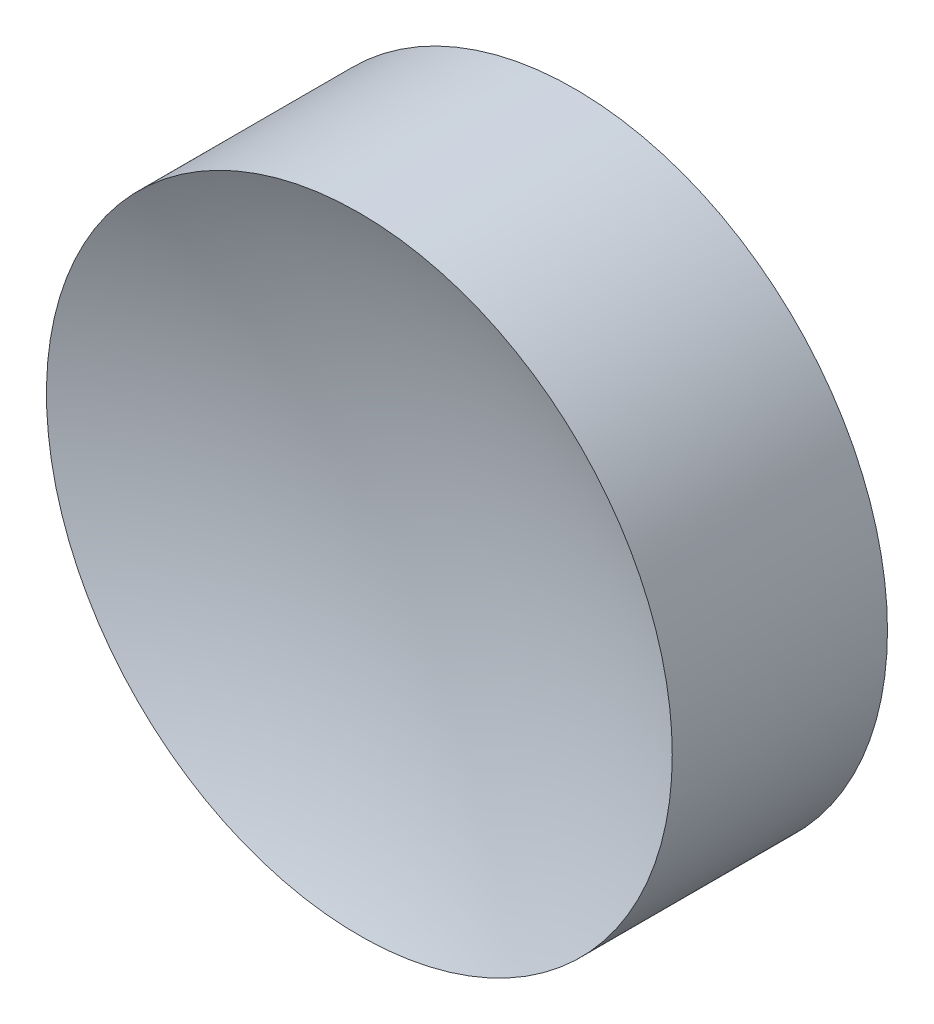
ISO-10303-21;
HEADER;
FILE_DESCRIPTION(('STEP AP214'),'2;1');
FILE_NAME('part.step','',(''),(''),'','','');
FILE_SCHEMA(('AUTOMOTIVE_DESIGN { 1 0 10303 214 1 1 1 1 }'));
ENDSEC;
DATA;
#1=APPLICATION_CONTEXT('core data for automotive mechanical design processes');
#2=APPLICATION_PROTOCOL_DEFINITION('international standard','automotive_design',2000,#1);
#3=PRODUCT_CONTEXT('',#1,'mechanical');
#4=PRODUCT('Part','Part','',(#3));
#5=PRODUCT_RELATED_PRODUCT_CATEGORY('part','',(#4));
#6=PRODUCT_DEFINITION_FORMATION('','',#4);
#7=PRODUCT_DEFINITION_CONTEXT('part definition',#1,'design');
#8=PRODUCT_DEFINITION('design','',#6,#7);
#9=PRODUCT_DEFINITION_SHAPE('','',#8);
#10=(LENGTH_UNIT() NAMED_UNIT(*) SI_UNIT(.MILLI.,.METRE.));
#11=(NAMED_UNIT(*) PLANE_ANGLE_UNIT() SI_UNIT($,.RADIAN.));
#12=(NAMED_UNIT(*) SI_UNIT($,.STERADIAN.) SOLID_ANGLE_UNIT());
#13=UNCERTAINTY_MEASURE_WITH_UNIT(LENGTH_MEASURE(1.E-05),#10,'distance_accuracy_value','');
#14=(GEOMETRIC_REPRESENTATION_CONTEXT(3) GLOBAL_UNCERTAINTY_ASSIGNED_CONTEXT((#13)) GLOBAL_UNIT_ASSIGNED_CONTEXT((#10,
#11,#12)) REPRESENTATION_CONTEXT('',''));
#15=CARTESIAN_POINT('',(0.,0.,0.));
#16=DIRECTION('',(0.,0.,1.));
#17=DIRECTION('',(1.,0.,0.));
#18=AXIS2_PLACEMENT_3D('',#15,#16,#17);
#19=CARTESIAN_POINT('',(0.,0.,16.2464009983786));
#20=DIRECTION('',(0.,0.,1.));
#21=DIRECTION('',(0.,1.,0.));
#22=AXIS2_PLACEMENT_3D('',#19,#20,#21);
#23=SPHERICAL_SURFACE('',#22,15.43);
#24=CARTESIAN_POINT('',(0.,0.,2.18359900162137));
#25=DIRECTION('',(0.,0.,1.));
#26=DIRECTION('',(1.,0.,0.));
#27=AXIS2_PLACEMENT_3D('',#24,#25,#26);
#28=CIRCLE('',#27,6.35);
#29=CARTESIAN_POINT('',(6.35,0.,2.18359900162137));
#30=VERTEX_POINT('',#29);
#31=EDGE_CURVE('E18',#30,#30,#28,.T.);
#32=ORIENTED_EDGE('',*,*,#31,.T.);
#33=EDGE_LOOP('',(#32));
#34=FACE_BOUND('',#33,.T.);
#35=ADVANCED_FACE('F12',(#34),#23,.F.);
#36=CARTESIAN_POINT('',(0.,0.,-2.18359900162137));
#37=DIRECTION('',(0.,0.,1.));
#38=DIRECTION('',(1.,0.,0.));
#39=AXIS2_PLACEMENT_3D('',#36,#37,#38);
#40=PLANE('',#39);
#41=CARTESIAN_POINT('',(0.,0.,-2.18359900162137));
#42=DIRECTION('',(0.,0.,1.));
#43=DIRECTION('',(1.,0.,0.));
#44=AXIS2_PLACEMENT_3D('',#41,#42,#43);
#45=CIRCLE('',#44,6.35);
#46=CARTESIAN_POINT('',(6.35,0.,-2.18359900162137));
#47=VERTEX_POINT('',#46);
#48=EDGE_CURVE('E8',#47,#47,#45,.T.);
#49=ORIENTED_EDGE('',*,*,#48,.F.);
#50=EDGE_LOOP('',(#49));
#51=FACE_BOUND('',#50,.T.);
#52=ADVANCED_FACE('F27',(#51),#40,.F.);
#53=CARTESIAN_POINT('',(0.,0.,8.33355426880795));
#54=DIRECTION('',(0.,0.,1.));
#55=DIRECTION('',(1.,0.,0.));
#56=AXIS2_PLACEMENT_3D('',#53,#54,#55);
#57=CYLINDRICAL_SURFACE('',#56,6.35);
#58=ORIENTED_EDGE('',*,*,#31,.F.);
#59=EDGE_LOOP('',(#58));
#60=FACE_BOUND('',#59,.T.);
#61=ORIENTED_EDGE('',*,*,#48,.T.);
#62=EDGE_LOOP('',(#61));
#63=FACE_BOUND('',#62,.T.);
#64=ADVANCED_FACE('F25',(#60,#63),#57,.T.);
#65=CLOSED_SHELL('',(#35,#52,#64));
#66=MANIFOLD_SOLID_BREP('B1',#65);
#67=ADVANCED_BREP_SHAPE_REPRESENTATION('',(#18,#66),#14);
#68=SHAPE_DEFINITION_REPRESENTATION(#9,#67);
ENDSEC;
END-ISO-10303-21;
